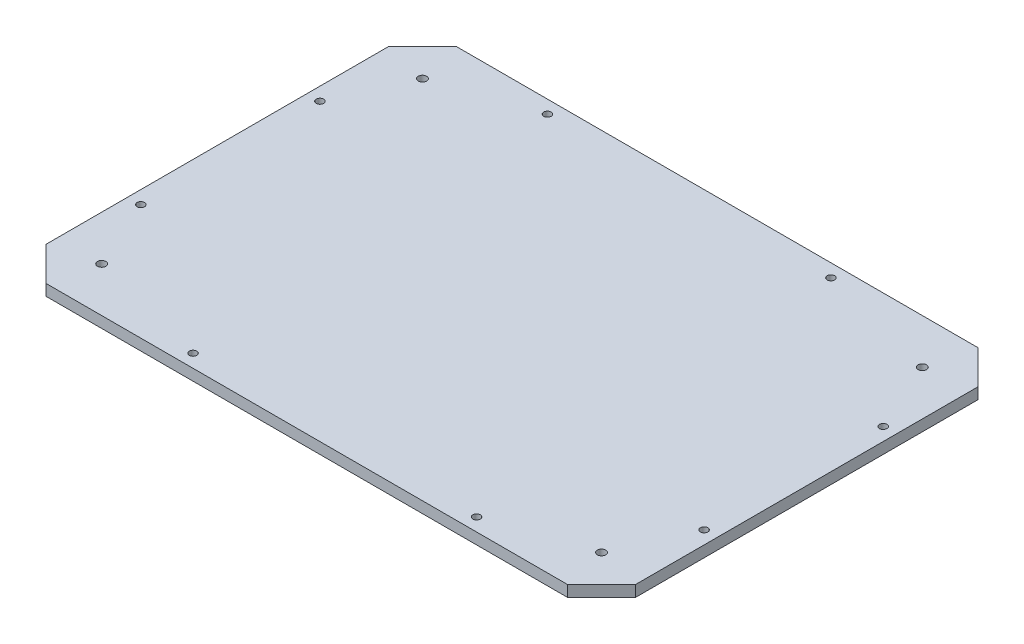
ISO-10303-21;
HEADER;
FILE_DESCRIPTION(('STEP AP214'),'2;1');
FILE_NAME('part.step','',(''),(''),'','','');
FILE_SCHEMA(('AUTOMOTIVE_DESIGN { 1 0 10303 214 1 1 1 1 }'));
ENDSEC;
DATA;
#1=APPLICATION_CONTEXT('core data for automotive mechanical design processes');
#2=APPLICATION_PROTOCOL_DEFINITION('international standard','automotive_design',2000,#1);
#3=PRODUCT_CONTEXT('',#1,'mechanical');
#4=PRODUCT('Part','Part','',(#3));
#5=PRODUCT_RELATED_PRODUCT_CATEGORY('part','',(#4));
#6=PRODUCT_DEFINITION_FORMATION('','',#4);
#7=PRODUCT_DEFINITION_CONTEXT('part definition',#1,'design');
#8=PRODUCT_DEFINITION('design','',#6,#7);
#9=PRODUCT_DEFINITION_SHAPE('','',#8);
#10=(LENGTH_UNIT() NAMED_UNIT(*) SI_UNIT(.MILLI.,.METRE.));
#11=(NAMED_UNIT(*) PLANE_ANGLE_UNIT() SI_UNIT($,.RADIAN.));
#12=(NAMED_UNIT(*) SI_UNIT($,.STERADIAN.) SOLID_ANGLE_UNIT());
#13=UNCERTAINTY_MEASURE_WITH_UNIT(LENGTH_MEASURE(1.E-05),#10,'distance_accuracy_value','');
#14=(GEOMETRIC_REPRESENTATION_CONTEXT(3) GLOBAL_UNCERTAINTY_ASSIGNED_CONTEXT((#13)) GLOBAL_UNIT_ASSIGNED_CONTEXT((#10,
#11,#12)) REPRESENTATION_CONTEXT('',''));
#15=CARTESIAN_POINT('',(0.,0.,0.));
#16=DIRECTION('',(0.,0.,1.));
#17=DIRECTION('',(1.,0.,0.));
#18=AXIS2_PLACEMENT_3D('',#15,#16,#17);
#19=CARTESIAN_POINT('',(8.4882527000098,9.52500000000001,0.));
#20=DIRECTION('',(1.,0.,0.));
#21=DIRECTION('',(0.,0.,-1.));
#22=AXIS2_PLACEMENT_3D('',#19,#20,#21);
#23=PLANE('',#22);
#24=DIRECTION('',(0.,0.,1.));
#25=VECTOR('',#24,1.);
#26=CARTESIAN_POINT('',(8.4882527000098,0.,0.));
#27=LINE('',#26,#25);
#28=CARTESIAN_POINT('',(8.48825270000981,0.,28.8254840000385));
#29=VERTEX_POINT('',#28);
#30=CARTESIAN_POINT('',(8.48825270000984,0.,320.424515999961));
#31=VERTEX_POINT('',#30);
#32=EDGE_CURVE('E130',#29,#31,#27,.T.);
#33=ORIENTED_EDGE('',*,*,#32,.T.);
#34=DIRECTION('',(0.,1.,0.));
#35=VECTOR('',#34,1.);
#36=CARTESIAN_POINT('',(8.48825270000981,-40.7653904148234,320.424515999961));
#37=LINE('',#36,#35);
#38=CARTESIAN_POINT('',(8.48825270000981,9.52500000000001,320.424515999961));
#39=VERTEX_POINT('',#38);
#40=EDGE_CURVE('E278',#31,#39,#37,.T.);
#41=ORIENTED_EDGE('',*,*,#40,.T.);
#42=DIRECTION('',(0.,0.,1.));
#43=VECTOR('',#42,1.);
#44=CARTESIAN_POINT('',(8.4882527000098,9.52500000000001,0.));
#45=LINE('',#44,#43);
#46=CARTESIAN_POINT('',(8.48825270000981,9.52500000000001,28.8254840000385));
#47=VERTEX_POINT('',#46);
#48=EDGE_CURVE('E126',#47,#39,#45,.T.);
#49=ORIENTED_EDGE('',*,*,#48,.F.);
#50=DIRECTION('',(0.,1.,0.));
#51=VECTOR('',#50,1.);
#52=CARTESIAN_POINT('',(8.48825270000981,-40.7653904148234,28.8254840000385));
#53=LINE('',#52,#51);
#54=EDGE_CURVE('E276',#29,#47,#53,.T.);
#55=ORIENTED_EDGE('',*,*,#54,.F.);
#56=EDGE_LOOP('',(#33,#41,#49,#55));
#57=FACE_BOUND('',#56,.T.);
#58=ADVANCED_FACE('F33',(#57),#23,.F.);
#59=CARTESIAN_POINT('',(8.48825270000984,9.52500000000001,349.25));
#60=DIRECTION('',(0.,0.,-1.));
#61=DIRECTION('',(-1.,0.,0.));
#62=AXIS2_PLACEMENT_3D('',#59,#60,#61);
#63=PLANE('',#62);
#64=DIRECTION('',(1.,0.,0.));
#65=VECTOR('',#64,1.);
#66=CARTESIAN_POINT('',(8.48825270000984,9.52500000000001,349.25));
#67=LINE('',#66,#65);
#68=CARTESIAN_POINT('',(37.3137367000486,9.52500000000001,349.25));
#69=VERTEX_POINT('',#68);
#70=CARTESIAN_POINT('',(481.312768699971,9.52500000000001,349.25));
#71=VERTEX_POINT('',#70);
#72=EDGE_CURVE('E122',#69,#71,#67,.T.);
#73=ORIENTED_EDGE('',*,*,#72,.F.);
#74=DIRECTION('',(0.,1.,0.));
#75=VECTOR('',#74,1.);
#76=CARTESIAN_POINT('',(37.3137367000486,-40.7653904148234,349.25));
#77=LINE('',#76,#75);
#78=CARTESIAN_POINT('',(37.3137367000486,0.,349.25));
#79=VERTEX_POINT('',#78);
#80=EDGE_CURVE('E281',#79,#69,#77,.T.);
#81=ORIENTED_EDGE('',*,*,#80,.F.);
#82=DIRECTION('',(1.,0.,0.));
#83=VECTOR('',#82,1.);
#84=CARTESIAN_POINT('',(8.48825270000984,0.,349.25));
#85=LINE('',#84,#83);
#86=CARTESIAN_POINT('',(481.312768699971,0.,349.25));
#87=VERTEX_POINT('',#86);
#88=EDGE_CURVE('E133',#79,#87,#85,.T.);
#89=ORIENTED_EDGE('',*,*,#88,.T.);
#90=DIRECTION('',(0.,1.,0.));
#91=VECTOR('',#90,1.);
#92=CARTESIAN_POINT('',(481.312768699971,-40.7653904148234,349.25));
#93=LINE('',#92,#91);
#94=EDGE_CURVE('E48',#87,#71,#93,.T.);
#95=ORIENTED_EDGE('',*,*,#94,.T.);
#96=EDGE_LOOP('',(#73,#81,#89,#95));
#97=FACE_BOUND('',#96,.T.);
#98=ADVANCED_FACE('F178',(#97),#63,.F.);
#99=CARTESIAN_POINT('',(510.13825270001,9.52500000000001,0.));
#100=DIRECTION('',(-1.,0.,0.));
#101=DIRECTION('',(0.,0.,1.));
#102=AXIS2_PLACEMENT_3D('',#99,#100,#101);
#103=PLANE('',#102);
#104=DIRECTION('',(0.,0.,-1.));
#105=VECTOR('',#104,1.);
#106=CARTESIAN_POINT('',(510.13825270001,9.52500000000001,0.));
#107=LINE('',#106,#105);
#108=CARTESIAN_POINT('',(510.13825270001,9.52500000000001,320.424515999961));
#109=VERTEX_POINT('',#108);
#110=CARTESIAN_POINT('',(510.13825270001,9.52500000000001,28.8254840000385));
#111=VERTEX_POINT('',#110);
#112=EDGE_CURVE('E111',#109,#111,#107,.T.);
#113=ORIENTED_EDGE('',*,*,#112,.F.);
#114=DIRECTION('',(0.,1.,0.));
#115=VECTOR('',#114,1.);
#116=CARTESIAN_POINT('',(510.13825270001,-40.7653904148234,320.424515999961));
#117=LINE('',#116,#115);
#118=CARTESIAN_POINT('',(510.13825270001,0.,320.424515999961));
#119=VERTEX_POINT('',#118);
#120=EDGE_CURVE('E305',#119,#109,#117,.T.);
#121=ORIENTED_EDGE('',*,*,#120,.F.);
#122=DIRECTION('',(0.,0.,-1.));
#123=VECTOR('',#122,1.);
#124=CARTESIAN_POINT('',(510.13825270001,0.,0.));
#125=LINE('',#124,#123);
#126=CARTESIAN_POINT('',(510.13825270001,0.,28.8254840000385));
#127=VERTEX_POINT('',#126);
#128=EDGE_CURVE('E113',#119,#127,#125,.T.);
#129=ORIENTED_EDGE('',*,*,#128,.T.);
#130=DIRECTION('',(0.,1.,0.));
#131=VECTOR('',#130,1.);
#132=CARTESIAN_POINT('',(510.13825270001,-40.7653904148234,28.8254840000385));
#133=LINE('',#132,#131);
#134=EDGE_CURVE('E56',#127,#111,#133,.T.);
#135=ORIENTED_EDGE('',*,*,#134,.T.);
#136=EDGE_LOOP('',(#113,#121,#129,#135));
#137=FACE_BOUND('',#136,.T.);
#138=ADVANCED_FACE('F109',(#137),#103,.F.);
#139=CARTESIAN_POINT('',(8.4882527000098,9.52500000000001,0.));
#140=DIRECTION('',(0.,0.,1.));
#141=DIRECTION('',(1.,0.,0.));
#142=AXIS2_PLACEMENT_3D('',#139,#140,#141);
#143=PLANE('',#142);
#144=DIRECTION('',(-1.,0.,0.));
#145=VECTOR('',#144,1.);
#146=CARTESIAN_POINT('',(8.4882527000098,9.52500000000001,0.));
#147=LINE('',#146,#145);
#148=CARTESIAN_POINT('',(481.312768699971,9.52500000000001,0.));
#149=VERTEX_POINT('',#148);
#150=CARTESIAN_POINT('',(37.3137367000486,9.52500000000001,0.));
#151=VERTEX_POINT('',#150);
#152=EDGE_CURVE('E121',#149,#151,#147,.T.);
#153=ORIENTED_EDGE('',*,*,#152,.F.);
#154=DIRECTION('',(0.,1.,0.));
#155=VECTOR('',#154,1.);
#156=CARTESIAN_POINT('',(481.312768699971,-40.7653904148234,0.));
#157=LINE('',#156,#155);
#158=CARTESIAN_POINT('',(481.312768699971,0.,0.));
#159=VERTEX_POINT('',#158);
#160=EDGE_CURVE('E99',#159,#149,#157,.T.);
#161=ORIENTED_EDGE('',*,*,#160,.F.);
#162=DIRECTION('',(-1.,0.,0.));
#163=VECTOR('',#162,1.);
#164=CARTESIAN_POINT('',(8.4882527000098,0.,0.));
#165=LINE('',#164,#163);
#166=CARTESIAN_POINT('',(37.3137367000487,0.,0.));
#167=VERTEX_POINT('',#166);
#168=EDGE_CURVE('E138',#159,#167,#165,.T.);
#169=ORIENTED_EDGE('',*,*,#168,.T.);
#170=DIRECTION('',(0.,1.,0.));
#171=VECTOR('',#170,1.);
#172=CARTESIAN_POINT('',(37.3137367000486,-40.7653904148234,0.));
#173=LINE('',#172,#171);
#174=EDGE_CURVE('E288',#167,#151,#173,.T.);
#175=ORIENTED_EDGE('',*,*,#174,.T.);
#176=EDGE_LOOP('',(#153,#161,#169,#175));
#177=FACE_BOUND('',#176,.T.);
#178=ADVANCED_FACE('F299',(#177),#143,.F.);
#179=CARTESIAN_POINT('',(0.,9.52500000000001,0.));
#180=DIRECTION('',(0.,1.,0.));
#181=DIRECTION('',(0.,0.,1.));
#182=AXIS2_PLACEMENT_3D('',#179,#180,#181);
#183=PLANE('',#182);
#184=DIRECTION('',(-0.707106781186551,0.,-0.707106781186544));
#185=VECTOR('',#184,1.);
#186=CARTESIAN_POINT('',(37.3137367000486,9.52500000000001,349.25));
#187=LINE('',#186,#185);
#188=EDGE_CURVE('E271',#69,#39,#187,.T.);
#189=ORIENTED_EDGE('',*,*,#188,.F.);
#190=ORIENTED_EDGE('',*,*,#72,.T.);
#191=DIRECTION('',(-0.707106781186551,0.,0.707106781186543));
#192=VECTOR('',#191,1.);
#193=CARTESIAN_POINT('',(481.312768699971,9.52500000000001,349.25));
#194=LINE('',#193,#192);
#195=EDGE_CURVE('E120',#109,#71,#194,.T.);
#196=ORIENTED_EDGE('',*,*,#195,.F.);
#197=ORIENTED_EDGE('',*,*,#112,.T.);
#198=DIRECTION('',(0.707106781186552,0.,0.707106781186543));
#199=VECTOR('',#198,1.);
#200=CARTESIAN_POINT('',(481.312768699971,9.52500000000001,0.));
#201=LINE('',#200,#199);
#202=EDGE_CURVE('E96',#149,#111,#201,.T.);
#203=ORIENTED_EDGE('',*,*,#202,.F.);
#204=ORIENTED_EDGE('',*,*,#152,.T.);
#205=DIRECTION('',(0.707106781186552,0.,-0.707106781186543));
#206=VECTOR('',#205,1.);
#207=CARTESIAN_POINT('',(37.3137367000486,9.52500000000001,0.));
#208=LINE('',#207,#206);
#209=EDGE_CURVE('E273',#47,#151,#208,.T.);
#210=ORIENTED_EDGE('',*,*,#209,.F.);
#211=ORIENTED_EDGE('',*,*,#48,.T.);
#212=EDGE_LOOP('',(#189,#190,#196,#197,#203,#204,#210,#211));
#213=FACE_BOUND('',#212,.T.);
#214=CARTESIAN_POINT('',(46.5882527000121,9.52500000000001,38.1000000000002));
#215=DIRECTION('',(0.,1.,0.));
#216=DIRECTION('',(0.,0.,1.));
#217=AXIS2_PLACEMENT_3D('',#214,#215,#216);
#218=CIRCLE('',#217,3.571875);
#219=CARTESIAN_POINT('',(46.5882527000121,9.52500000000001,41.6718750000002));
#220=VERTEX_POINT('',#219);
#221=EDGE_CURVE('E210',#220,#220,#218,.T.);
#222=ORIENTED_EDGE('',*,*,#221,.F.);
#223=EDGE_LOOP('',(#222));
#224=FACE_BOUND('',#223,.T.);
#225=CARTESIAN_POINT('',(46.5882527000121,9.52500000000001,311.149999999993));
#226=DIRECTION('',(0.,1.,0.));
#227=DIRECTION('',(0.,0.,1.));
#228=AXIS2_PLACEMENT_3D('',#225,#226,#227);
#229=CIRCLE('',#228,3.571875);
#230=CARTESIAN_POINT('',(46.5882527000121,9.52500000000001,314.721874999993));
#231=VERTEX_POINT('',#230);
#232=EDGE_CURVE('E207',#231,#231,#229,.T.);
#233=ORIENTED_EDGE('',*,*,#232,.F.);
#234=EDGE_LOOP('',(#233));
#235=FACE_BOUND('',#234,.T.);
#236=CARTESIAN_POINT('',(472.038252700011,9.52500000000001,311.149999999993));
#237=DIRECTION('',(0.,1.,0.));
#238=DIRECTION('',(0.,0.,1.));
#239=AXIS2_PLACEMENT_3D('',#236,#237,#238);
#240=CIRCLE('',#239,3.57187499999998);
#241=CARTESIAN_POINT('',(472.038252700011,9.52500000000001,314.721874999993));
#242=VERTEX_POINT('',#241);
#243=EDGE_CURVE('E209',#242,#242,#240,.T.);
#244=ORIENTED_EDGE('',*,*,#243,.F.);
#245=EDGE_LOOP('',(#244));
#246=FACE_BOUND('',#245,.T.);
#247=CARTESIAN_POINT('',(472.038252700012,9.52500000000001,38.0999999999988));
#248=DIRECTION('',(0.,1.,0.));
#249=DIRECTION('',(0.,0.,1.));
#250=AXIS2_PLACEMENT_3D('',#247,#248,#249);
#251=CIRCLE('',#250,3.57187499999998);
#252=CARTESIAN_POINT('',(472.038252700012,9.52500000000001,41.6718749999988));
#253=VERTEX_POINT('',#252);
#254=EDGE_CURVE('E213',#253,#253,#251,.T.);
#255=ORIENTED_EDGE('',*,*,#254,.F.);
#256=EDGE_LOOP('',(#255));
#257=FACE_BOUND('',#256,.T.);
#258=CARTESIAN_POINT('',(499.02575270001,9.52500000000001,98.4250000000003));
#259=DIRECTION('',(0.,1.,0.));
#260=DIRECTION('',(0.,0.,1.));
#261=AXIS2_PLACEMENT_3D('',#258,#259,#260);
#262=CIRCLE('',#261,3.17500000000014);
#263=CARTESIAN_POINT('',(499.02575270001,9.52500000000001,101.6));
#264=VERTEX_POINT('',#263);
#265=EDGE_CURVE('E222',#264,#264,#262,.T.);
#266=ORIENTED_EDGE('',*,*,#265,.F.);
#267=EDGE_LOOP('',(#266));
#268=FACE_BOUND('',#267,.T.);
#269=CARTESIAN_POINT('',(499.025752700008,9.52500000000001,250.825));
#270=DIRECTION('',(0.,1.,0.));
#271=DIRECTION('',(0.,0.,1.));
#272=AXIS2_PLACEMENT_3D('',#269,#270,#271);
#273=CIRCLE('',#272,3.17499999999997);
#274=CARTESIAN_POINT('',(499.025752700008,9.52500000000001,254.));
#275=VERTEX_POINT('',#274);
#276=EDGE_CURVE('E237',#275,#275,#273,.T.);
#277=ORIENTED_EDGE('',*,*,#276,.F.);
#278=EDGE_LOOP('',(#277));
#279=FACE_BOUND('',#278,.T.);
#280=CARTESIAN_POINT('',(19.6007527000113,9.52500000000001,98.4249999999999));
#281=DIRECTION('',(0.,1.,0.));
#282=DIRECTION('',(0.,0.,1.));
#283=AXIS2_PLACEMENT_3D('',#280,#281,#282);
#284=CIRCLE('',#283,3.17500000000001);
#285=CARTESIAN_POINT('',(19.6007527000113,9.52500000000001,101.6));
#286=VERTEX_POINT('',#285);
#287=EDGE_CURVE('E231',#286,#286,#284,.T.);
#288=ORIENTED_EDGE('',*,*,#287,.F.);
#289=EDGE_LOOP('',(#288));
#290=FACE_BOUND('',#289,.T.);
#291=CARTESIAN_POINT('',(19.6007527000118,9.52500000000001,250.825));
#292=DIRECTION('',(0.,1.,0.));
#293=DIRECTION('',(0.,0.,1.));
#294=AXIS2_PLACEMENT_3D('',#291,#292,#293);
#295=CIRCLE('',#294,3.17500000000003);
#296=CARTESIAN_POINT('',(19.6007527000118,9.52500000000001,254.));
#297=VERTEX_POINT('',#296);
#298=EDGE_CURVE('E223',#297,#297,#295,.T.);
#299=ORIENTED_EDGE('',*,*,#298,.F.);
#300=EDGE_LOOP('',(#299));
#301=FACE_BOUND('',#300,.T.);
#302=CARTESIAN_POINT('',(125.963252700011,9.52500000000001,11.1125000000004));
#303=DIRECTION('',(0.,1.,0.));
#304=DIRECTION('',(0.,0.,1.));
#305=AXIS2_PLACEMENT_3D('',#302,#303,#304);
#306=CIRCLE('',#305,3.17499999999997);
#307=CARTESIAN_POINT('',(125.963252700011,9.52500000000001,14.2875000000004));
#308=VERTEX_POINT('',#307);
#309=EDGE_CURVE('E230',#308,#308,#306,.T.);
#310=ORIENTED_EDGE('',*,*,#309,.F.);
#311=EDGE_LOOP('',(#310));
#312=FACE_BOUND('',#311,.T.);
#313=CARTESIAN_POINT('',(367.263252700011,9.52500000000001,11.1125000000004));
#314=DIRECTION('',(0.,1.,0.));
#315=DIRECTION('',(0.,0.,1.));
#316=AXIS2_PLACEMENT_3D('',#313,#314,#315);
#317=CIRCLE('',#316,3.17499999999997);
#318=CARTESIAN_POINT('',(367.263252700011,9.52500000000001,14.2875000000004));
#319=VERTEX_POINT('',#318);
#320=EDGE_CURVE('E255',#319,#319,#317,.T.);
#321=ORIENTED_EDGE('',*,*,#320,.F.);
#322=EDGE_LOOP('',(#321));
#323=FACE_BOUND('',#322,.T.);
#324=CARTESIAN_POINT('',(151.363252700012,9.52500000000001,338.137499999998));
#325=DIRECTION('',(0.,1.,0.));
#326=DIRECTION('',(0.,0.,1.));
#327=AXIS2_PLACEMENT_3D('',#324,#325,#326);
#328=CIRCLE('',#327,3.175);
#329=CARTESIAN_POINT('',(151.363252700012,9.52500000000001,341.312499999998));
#330=VERTEX_POINT('',#329);
#331=EDGE_CURVE('E247',#330,#330,#328,.T.);
#332=ORIENTED_EDGE('',*,*,#331,.F.);
#333=EDGE_LOOP('',(#332));
#334=FACE_BOUND('',#333,.T.);
#335=CARTESIAN_POINT('',(392.663252700012,9.52500000000001,338.137499999995));
#336=DIRECTION('',(0.,1.,0.));
#337=DIRECTION('',(0.,0.,1.));
#338=AXIS2_PLACEMENT_3D('',#335,#336,#337);
#339=CIRCLE('',#338,3.17499999999997);
#340=CARTESIAN_POINT('',(392.663252700012,9.52500000000001,341.312499999995));
#341=VERTEX_POINT('',#340);
#342=EDGE_CURVE('E254',#341,#341,#339,.T.);
#343=ORIENTED_EDGE('',*,*,#342,.F.);
#344=EDGE_LOOP('',(#343));
#345=FACE_BOUND('',#344,.T.);
#346=ADVANCED_FACE('F117',(#213,#224,#235,#246,#257,#268,#279,#290,#301,#312,#323,#334,#345),
#183,.T.);
#347=CARTESIAN_POINT('',(0.,0.,0.));
#348=DIRECTION('',(0.,1.,0.));
#349=DIRECTION('',(0.,0.,1.));
#350=AXIS2_PLACEMENT_3D('',#347,#348,#349);
#351=PLANE('',#350);
#352=CARTESIAN_POINT('',(46.5882527000121,0.,311.149999999993));
#353=DIRECTION('',(0.,1.,0.));
#354=DIRECTION('',(0.,0.,1.));
#355=AXIS2_PLACEMENT_3D('',#352,#353,#354);
#356=CIRCLE('',#355,6.49287500000001);
#357=CARTESIAN_POINT('',(46.5882527000121,0.,317.642874999993));
#358=VERTEX_POINT('',#357);
#359=EDGE_CURVE('E152',#358,#358,#356,.T.);
#360=ORIENTED_EDGE('',*,*,#359,.T.);
#361=EDGE_LOOP('',(#360));
#362=FACE_BOUND('',#361,.T.);
#363=CARTESIAN_POINT('',(46.5882527000121,0.,38.1000000000002));
#364=DIRECTION('',(0.,1.,0.));
#365=DIRECTION('',(0.,0.,1.));
#366=AXIS2_PLACEMENT_3D('',#363,#364,#365);
#367=CIRCLE('',#366,6.49287499999995);
#368=CARTESIAN_POINT('',(46.5882527000121,0.,44.5928750000001));
#369=VERTEX_POINT('',#368);
#370=EDGE_CURVE('E149',#369,#369,#367,.T.);
#371=ORIENTED_EDGE('',*,*,#370,.T.);
#372=EDGE_LOOP('',(#371));
#373=FACE_BOUND('',#372,.T.);
#374=CARTESIAN_POINT('',(472.038252700012,0.,38.0999999999988));
#375=DIRECTION('',(0.,1.,0.));
#376=DIRECTION('',(0.,0.,1.));
#377=AXIS2_PLACEMENT_3D('',#374,#375,#376);
#378=CIRCLE('',#377,6.49287500000001);
#379=CARTESIAN_POINT('',(472.038252700012,0.,44.5928749999988));
#380=VERTEX_POINT('',#379);
#381=EDGE_CURVE('E146',#380,#380,#378,.T.);
#382=ORIENTED_EDGE('',*,*,#381,.T.);
#383=EDGE_LOOP('',(#382));
#384=FACE_BOUND('',#383,.T.);
#385=CARTESIAN_POINT('',(472.038252700011,0.,311.149999999993));
#386=DIRECTION('',(0.,1.,0.));
#387=DIRECTION('',(0.,0.,1.));
#388=AXIS2_PLACEMENT_3D('',#385,#386,#387);
#389=CIRCLE('',#388,6.49287499999995);
#390=CARTESIAN_POINT('',(472.038252700011,0.,317.642874999993));
#391=VERTEX_POINT('',#390);
#392=EDGE_CURVE('E143',#391,#391,#389,.T.);
#393=ORIENTED_EDGE('',*,*,#392,.T.);
#394=EDGE_LOOP('',(#393));
#395=FACE_BOUND('',#394,.T.);
#396=CARTESIAN_POINT('',(499.02575270001,0.,98.4250000000003));
#397=DIRECTION('',(0.,1.,0.));
#398=DIRECTION('',(0.,0.,1.));
#399=AXIS2_PLACEMENT_3D('',#396,#397,#398);
#400=CIRCLE('',#399,3.17500000000014);
#401=CARTESIAN_POINT('',(499.02575270001,0.,101.6));
#402=VERTEX_POINT('',#401);
#403=EDGE_CURVE('E240',#402,#402,#400,.F.);
#404=ORIENTED_EDGE('',*,*,#403,.F.);
#405=EDGE_LOOP('',(#404));
#406=FACE_BOUND('',#405,.T.);
#407=CARTESIAN_POINT('',(499.025752700008,0.,250.825));
#408=DIRECTION('',(0.,1.,0.));
#409=DIRECTION('',(0.,0.,1.));
#410=AXIS2_PLACEMENT_3D('',#407,#408,#409);
#411=CIRCLE('',#410,3.17499999999997);
#412=CARTESIAN_POINT('',(499.025752700008,0.,254.));
#413=VERTEX_POINT('',#412);
#414=EDGE_CURVE('E234',#413,#413,#411,.F.);
#415=ORIENTED_EDGE('',*,*,#414,.F.);
#416=EDGE_LOOP('',(#415));
#417=FACE_BOUND('',#416,.T.);
#418=CARTESIAN_POINT('',(19.6007527000113,0.,98.4249999999999));
#419=DIRECTION('',(0.,1.,0.));
#420=DIRECTION('',(0.,0.,1.));
#421=AXIS2_PLACEMENT_3D('',#418,#419,#420);
#422=CIRCLE('',#421,3.17500000000001);
#423=CARTESIAN_POINT('',(19.6007527000113,0.,101.6));
#424=VERTEX_POINT('',#423);
#425=EDGE_CURVE('E227',#424,#424,#422,.F.);
#426=ORIENTED_EDGE('',*,*,#425,.F.);
#427=EDGE_LOOP('',(#426));
#428=FACE_BOUND('',#427,.T.);
#429=CARTESIAN_POINT('',(19.6007527000118,0.,250.825));
#430=DIRECTION('',(0.,1.,0.));
#431=DIRECTION('',(0.,0.,1.));
#432=AXIS2_PLACEMENT_3D('',#429,#430,#431);
#433=CIRCLE('',#432,3.17500000000003);
#434=CARTESIAN_POINT('',(19.6007527000118,0.,254.));
#435=VERTEX_POINT('',#434);
#436=EDGE_CURVE('E226',#435,#435,#433,.F.);
#437=ORIENTED_EDGE('',*,*,#436,.F.);
#438=EDGE_LOOP('',(#437));
#439=FACE_BOUND('',#438,.T.);
#440=CARTESIAN_POINT('',(125.963252700011,0.,11.1125000000004));
#441=DIRECTION('',(0.,1.,0.));
#442=DIRECTION('',(0.,0.,1.));
#443=AXIS2_PLACEMENT_3D('',#440,#441,#442);
#444=CIRCLE('',#443,3.17499999999997);
#445=CARTESIAN_POINT('',(125.963252700011,0.,14.2875000000004));
#446=VERTEX_POINT('',#445);
#447=EDGE_CURVE('E258',#446,#446,#444,.F.);
#448=ORIENTED_EDGE('',*,*,#447,.F.);
#449=EDGE_LOOP('',(#448));
#450=FACE_BOUND('',#449,.T.);
#451=CARTESIAN_POINT('',(367.263252700011,0.,11.1125000000004));
#452=DIRECTION('',(0.,1.,0.));
#453=DIRECTION('',(0.,0.,1.));
#454=AXIS2_PLACEMENT_3D('',#451,#452,#453);
#455=CIRCLE('',#454,3.17499999999997);
#456=CARTESIAN_POINT('',(367.263252700011,0.,14.2875000000004));
#457=VERTEX_POINT('',#456);
#458=EDGE_CURVE('E251',#457,#457,#455,.F.);
#459=ORIENTED_EDGE('',*,*,#458,.F.);
#460=EDGE_LOOP('',(#459));
#461=FACE_BOUND('',#460,.T.);
#462=CARTESIAN_POINT('',(151.363252700012,0.,338.137499999998));
#463=DIRECTION('',(0.,1.,0.));
#464=DIRECTION('',(0.,0.,1.));
#465=AXIS2_PLACEMENT_3D('',#462,#463,#464);
#466=CIRCLE('',#465,3.175);
#467=CARTESIAN_POINT('',(151.363252700012,0.,341.312499999998));
#468=VERTEX_POINT('',#467);
#469=EDGE_CURVE('E250',#468,#468,#466,.F.);
#470=ORIENTED_EDGE('',*,*,#469,.F.);
#471=EDGE_LOOP('',(#470));
#472=FACE_BOUND('',#471,.T.);
#473=CARTESIAN_POINT('',(392.663252700012,0.,338.137499999995));
#474=DIRECTION('',(0.,1.,0.));
#475=DIRECTION('',(0.,0.,1.));
#476=AXIS2_PLACEMENT_3D('',#473,#474,#475);
#477=CIRCLE('',#476,3.17499999999997);
#478=CARTESIAN_POINT('',(392.663252700012,0.,341.312499999995));
#479=VERTEX_POINT('',#478);
#480=EDGE_CURVE('E134',#479,#479,#477,.F.);
#481=ORIENTED_EDGE('',*,*,#480,.F.);
#482=EDGE_LOOP('',(#481));
#483=FACE_BOUND('',#482,.T.);
#484=ORIENTED_EDGE('',*,*,#88,.F.);
#485=DIRECTION('',(0.707106781186551,0.,0.707106781186544));
#486=VECTOR('',#485,1.);
#487=CARTESIAN_POINT('',(37.3137367000486,0.,349.25));
#488=LINE('',#487,#486);
#489=EDGE_CURVE('E283',#31,#79,#488,.T.);
#490=ORIENTED_EDGE('',*,*,#489,.F.);
#491=ORIENTED_EDGE('',*,*,#32,.F.);
#492=DIRECTION('',(-0.707106781186552,0.,0.707106781186543));
#493=VECTOR('',#492,1.);
#494=CARTESIAN_POINT('',(37.3137367000486,0.,0.));
#495=LINE('',#494,#493);
#496=EDGE_CURVE('E216',#167,#29,#495,.T.);
#497=ORIENTED_EDGE('',*,*,#496,.F.);
#498=ORIENTED_EDGE('',*,*,#168,.F.);
#499=DIRECTION('',(-0.707106781186552,0.,-0.707106781186543));
#500=VECTOR('',#499,1.);
#501=CARTESIAN_POINT('',(481.312768699971,0.,0.));
#502=LINE('',#501,#500);
#503=EDGE_CURVE('E290',#127,#159,#502,.T.);
#504=ORIENTED_EDGE('',*,*,#503,.F.);
#505=ORIENTED_EDGE('',*,*,#128,.F.);
#506=DIRECTION('',(0.707106781186552,0.,-0.707106781186544));
#507=VECTOR('',#506,1.);
#508=CARTESIAN_POINT('',(481.312768699971,0.,349.25));
#509=LINE('',#508,#507);
#510=EDGE_CURVE('E104',#87,#119,#509,.T.);
#511=ORIENTED_EDGE('',*,*,#510,.F.);
#512=EDGE_LOOP('',(#484,#490,#491,#497,#498,#504,#505,#511));
#513=FACE_BOUND('',#512,.T.);
#514=ADVANCED_FACE('F297',(#362,#373,#384,#395,#406,#417,#428,#439,#450,#461,#472,#483,#513),
#351,.F.);
#515=CARTESIAN_POINT('',(392.663252700012,-8.98025612106951,338.137499999995));
#516=DIRECTION('',(0.,1.,0.));
#517=DIRECTION('',(0.,0.,1.));
#518=AXIS2_PLACEMENT_3D('',#515,#516,#517);
#519=CYLINDRICAL_SURFACE('',#518,3.17499999999997);
#520=ORIENTED_EDGE('',*,*,#480,.T.);
#521=EDGE_LOOP('',(#520));
#522=FACE_BOUND('',#521,.T.);
#523=ORIENTED_EDGE('',*,*,#342,.T.);
#524=EDGE_LOOP('',(#523));
#525=FACE_BOUND('',#524,.T.);
#526=ADVANCED_FACE('F348',(#522,#525),#519,.F.);
#527=CARTESIAN_POINT('',(151.363252700012,-8.98025612106951,338.137499999998));
#528=DIRECTION('',(0.,1.,0.));
#529=DIRECTION('',(0.,0.,1.));
#530=AXIS2_PLACEMENT_3D('',#527,#528,#529);
#531=CYLINDRICAL_SURFACE('',#530,3.175);
#532=ORIENTED_EDGE('',*,*,#469,.T.);
#533=EDGE_LOOP('',(#532));
#534=FACE_BOUND('',#533,.T.);
#535=ORIENTED_EDGE('',*,*,#331,.T.);
#536=EDGE_LOOP('',(#535));
#537=FACE_BOUND('',#536,.T.);
#538=ADVANCED_FACE('F344',(#534,#537),#531,.F.);
#539=CARTESIAN_POINT('',(367.263252700011,-8.98025612106951,11.1125000000004));
#540=DIRECTION('',(0.,1.,0.));
#541=DIRECTION('',(0.,0.,1.));
#542=AXIS2_PLACEMENT_3D('',#539,#540,#541);
#543=CYLINDRICAL_SURFACE('',#542,3.17499999999997);
#544=ORIENTED_EDGE('',*,*,#458,.T.);
#545=EDGE_LOOP('',(#544));
#546=FACE_BOUND('',#545,.T.);
#547=ORIENTED_EDGE('',*,*,#320,.T.);
#548=EDGE_LOOP('',(#547));
#549=FACE_BOUND('',#548,.T.);
#550=ADVANCED_FACE('F347',(#546,#549),#543,.F.);
#551=CARTESIAN_POINT('',(125.963252700011,-8.98025612106951,11.1125000000004));
#552=DIRECTION('',(0.,1.,0.));
#553=DIRECTION('',(0.,0.,1.));
#554=AXIS2_PLACEMENT_3D('',#551,#552,#553);
#555=CYLINDRICAL_SURFACE('',#554,3.17499999999997);
#556=ORIENTED_EDGE('',*,*,#447,.T.);
#557=EDGE_LOOP('',(#556));
#558=FACE_BOUND('',#557,.T.);
#559=ORIENTED_EDGE('',*,*,#309,.T.);
#560=EDGE_LOOP('',(#559));
#561=FACE_BOUND('',#560,.T.);
#562=ADVANCED_FACE('F332',(#558,#561),#555,.F.);
#563=CARTESIAN_POINT('',(19.6007527000118,-8.98025612106951,250.825));
#564=DIRECTION('',(0.,1.,0.));
#565=DIRECTION('',(0.,0.,1.));
#566=AXIS2_PLACEMENT_3D('',#563,#564,#565);
#567=CYLINDRICAL_SURFACE('',#566,3.17500000000003);
#568=ORIENTED_EDGE('',*,*,#436,.T.);
#569=EDGE_LOOP('',(#568));
#570=FACE_BOUND('',#569,.T.);
#571=ORIENTED_EDGE('',*,*,#298,.T.);
#572=EDGE_LOOP('',(#571));
#573=FACE_BOUND('',#572,.T.);
#574=ADVANCED_FACE('F328',(#570,#573),#567,.F.);
#575=CARTESIAN_POINT('',(19.6007527000113,-8.98025612106951,98.4249999999999));
#576=DIRECTION('',(0.,1.,0.));
#577=DIRECTION('',(0.,0.,1.));
#578=AXIS2_PLACEMENT_3D('',#575,#576,#577);
#579=CYLINDRICAL_SURFACE('',#578,3.17500000000001);
#580=ORIENTED_EDGE('',*,*,#425,.T.);
#581=EDGE_LOOP('',(#580));
#582=FACE_BOUND('',#581,.T.);
#583=ORIENTED_EDGE('',*,*,#287,.T.);
#584=EDGE_LOOP('',(#583));
#585=FACE_BOUND('',#584,.T.);
#586=ADVANCED_FACE('F331',(#582,#585),#579,.F.);
#587=CARTESIAN_POINT('',(499.025752700008,-8.98025612106951,250.825));
#588=DIRECTION('',(0.,1.,0.));
#589=DIRECTION('',(0.,0.,1.));
#590=AXIS2_PLACEMENT_3D('',#587,#588,#589);
#591=CYLINDRICAL_SURFACE('',#590,3.17499999999997);
#592=ORIENTED_EDGE('',*,*,#414,.T.);
#593=EDGE_LOOP('',(#592));
#594=FACE_BOUND('',#593,.T.);
#595=ORIENTED_EDGE('',*,*,#276,.T.);
#596=EDGE_LOOP('',(#595));
#597=FACE_BOUND('',#596,.T.);
#598=ADVANCED_FACE('F336',(#594,#597),#591,.F.);
#599=CARTESIAN_POINT('',(499.02575270001,-8.98025612106951,98.4250000000003));
#600=DIRECTION('',(0.,1.,0.));
#601=DIRECTION('',(0.,0.,1.));
#602=AXIS2_PLACEMENT_3D('',#599,#600,#601);
#603=CYLINDRICAL_SURFACE('',#602,3.17500000000014);
#604=ORIENTED_EDGE('',*,*,#403,.T.);
#605=EDGE_LOOP('',(#604));
#606=FACE_BOUND('',#605,.T.);
#607=ORIENTED_EDGE('',*,*,#265,.T.);
#608=EDGE_LOOP('',(#607));
#609=FACE_BOUND('',#608,.T.);
#610=ADVANCED_FACE('F327',(#606,#609),#603,.F.);
#611=CARTESIAN_POINT('',(472.038252700012,-10.1027881362028,38.0999999999988));
#612=DIRECTION('',(0.,1.,0.));
#613=DIRECTION('',(0.,0.,1.));
#614=AXIS2_PLACEMENT_3D('',#611,#612,#613);
#615=CYLINDRICAL_SURFACE('',#614,3.57187499999998);
#616=CARTESIAN_POINT('',(472.038252700012,2.63008021339406,38.0999999999988));
#617=DIRECTION('',(0.,1.,0.));
#618=DIRECTION('',(0.,0.,1.));
#619=AXIS2_PLACEMENT_3D('',#616,#617,#618);
#620=CIRCLE('',#619,3.57187499999998);
#621=CARTESIAN_POINT('',(472.038252700012,2.63008021339406,41.6718749999988));
#622=VERTEX_POINT('',#621);
#623=EDGE_CURVE('E41',#622,#622,#620,.F.);
#624=ORIENTED_EDGE('',*,*,#623,.T.);
#625=EDGE_LOOP('',(#624));
#626=FACE_BOUND('',#625,.T.);
#627=ORIENTED_EDGE('',*,*,#254,.T.);
#628=EDGE_LOOP('',(#627));
#629=FACE_BOUND('',#628,.T.);
#630=ADVANCED_FACE('F160',(#626,#629),#615,.F.);
#631=CARTESIAN_POINT('',(472.038252700011,-10.1027881362028,311.149999999993));
#632=DIRECTION('',(0.,1.,0.));
#633=DIRECTION('',(0.,0.,1.));
#634=AXIS2_PLACEMENT_3D('',#631,#632,#633);
#635=CYLINDRICAL_SURFACE('',#634,3.57187499999998);
#636=CARTESIAN_POINT('',(472.038252700011,2.630080213394,311.149999999993));
#637=DIRECTION('',(0.,1.,0.));
#638=DIRECTION('',(0.,0.,1.));
#639=AXIS2_PLACEMENT_3D('',#636,#637,#638);
#640=CIRCLE('',#639,3.57187499999998);
#641=CARTESIAN_POINT('',(472.038252700011,2.630080213394,314.721874999993));
#642=VERTEX_POINT('',#641);
#643=EDGE_CURVE('E11',#642,#642,#640,.F.);
#644=ORIENTED_EDGE('',*,*,#643,.T.);
#645=EDGE_LOOP('',(#644));
#646=FACE_BOUND('',#645,.T.);
#647=ORIENTED_EDGE('',*,*,#243,.T.);
#648=EDGE_LOOP('',(#647));
#649=FACE_BOUND('',#648,.T.);
#650=ADVANCED_FACE('F203',(#646,#649),#635,.F.);
#651=CARTESIAN_POINT('',(46.5882527000121,-10.1027881362028,311.149999999993));
#652=DIRECTION('',(0.,1.,0.));
#653=DIRECTION('',(0.,0.,1.));
#654=AXIS2_PLACEMENT_3D('',#651,#652,#653);
#655=CYLINDRICAL_SURFACE('',#654,3.571875);
#656=CARTESIAN_POINT('',(46.5882527000121,2.630080213394,311.149999999993));
#657=DIRECTION('',(0.,1.,0.));
#658=DIRECTION('',(0.,0.,1.));
#659=AXIS2_PLACEMENT_3D('',#656,#657,#658);
#660=CIRCLE('',#659,3.571875);
#661=CARTESIAN_POINT('',(46.5882527000121,2.630080213394,314.721874999993));
#662=VERTEX_POINT('',#661);
#663=EDGE_CURVE('E124',#662,#662,#660,.F.);
#664=ORIENTED_EDGE('',*,*,#663,.T.);
#665=EDGE_LOOP('',(#664));
#666=FACE_BOUND('',#665,.T.);
#667=ORIENTED_EDGE('',*,*,#232,.T.);
#668=EDGE_LOOP('',(#667));
#669=FACE_BOUND('',#668,.T.);
#670=ADVANCED_FACE('F194',(#666,#669),#655,.F.);
#671=CARTESIAN_POINT('',(46.5882527000121,-10.1027881362028,38.1000000000002));
#672=DIRECTION('',(0.,1.,0.));
#673=DIRECTION('',(0.,0.,1.));
#674=AXIS2_PLACEMENT_3D('',#671,#672,#673);
#675=CYLINDRICAL_SURFACE('',#674,3.571875);
#676=CARTESIAN_POINT('',(46.5882527000121,2.63008021339395,38.1000000000002));
#677=DIRECTION('',(0.,1.,0.));
#678=DIRECTION('',(0.,0.,1.));
#679=AXIS2_PLACEMENT_3D('',#676,#677,#678);
#680=CIRCLE('',#679,3.571875);
#681=CARTESIAN_POINT('',(46.5882527000121,2.63008021339395,41.6718750000002));
#682=VERTEX_POINT('',#681);
#683=EDGE_CURVE('E155',#682,#682,#680,.F.);
#684=ORIENTED_EDGE('',*,*,#683,.T.);
#685=EDGE_LOOP('',(#684));
#686=FACE_BOUND('',#685,.T.);
#687=ORIENTED_EDGE('',*,*,#221,.T.);
#688=EDGE_LOOP('',(#687));
#689=FACE_BOUND('',#688,.T.);
#690=ADVANCED_FACE('F189',(#686,#689),#675,.F.);
#691=CARTESIAN_POINT('',(46.5882527000121,2.630080213394,311.149999999993));
#692=DIRECTION('',(0.,-1.,0.));
#693=DIRECTION('',(0.,0.,-1.));
#694=AXIS2_PLACEMENT_3D('',#691,#692,#693);
#695=CONICAL_SURFACE('',#694,3.571875,0.837758040957274);
#696=ORIENTED_EDGE('',*,*,#359,.F.);
#697=EDGE_LOOP('',(#696));
#698=FACE_BOUND('',#697,.T.);
#699=ORIENTED_EDGE('',*,*,#663,.F.);
#700=EDGE_LOOP('',(#699));
#701=FACE_BOUND('',#700,.T.);
#702=ADVANCED_FACE('F173',(#698,#701),#695,.F.);
#703=CARTESIAN_POINT('',(46.5882527000121,2.63008021339395,38.1000000000002));
#704=DIRECTION('',(0.,-1.,0.));
#705=DIRECTION('',(0.,0.,-1.));
#706=AXIS2_PLACEMENT_3D('',#703,#704,#705);
#707=CONICAL_SURFACE('',#706,3.571875,0.837758040957276);
#708=ORIENTED_EDGE('',*,*,#370,.F.);
#709=EDGE_LOOP('',(#708));
#710=FACE_BOUND('',#709,.T.);
#711=ORIENTED_EDGE('',*,*,#683,.F.);
#712=EDGE_LOOP('',(#711));
#713=FACE_BOUND('',#712,.T.);
#714=ADVANCED_FACE('F165',(#710,#713),#707,.F.);
#715=CARTESIAN_POINT('',(472.038252700012,2.63008021339406,38.0999999999988));
#716=DIRECTION('',(0.,-1.,0.));
#717=DIRECTION('',(0.,0.,-1.));
#718=AXIS2_PLACEMENT_3D('',#715,#716,#717);
#719=CONICAL_SURFACE('',#718,3.57187499999998,0.837758040957274);
#720=ORIENTED_EDGE('',*,*,#381,.F.);
#721=EDGE_LOOP('',(#720));
#722=FACE_BOUND('',#721,.T.);
#723=ORIENTED_EDGE('',*,*,#623,.F.);
#724=EDGE_LOOP('',(#723));
#725=FACE_BOUND('',#724,.T.);
#726=ADVANCED_FACE('F163',(#722,#725),#719,.F.);
#727=CARTESIAN_POINT('',(472.038252700011,2.630080213394,311.149999999993));
#728=DIRECTION('',(0.,-1.,0.));
#729=DIRECTION('',(0.,0.,-1.));
#730=AXIS2_PLACEMENT_3D('',#727,#728,#729);
#731=CONICAL_SURFACE('',#730,3.57187499999998,0.837758040957275);
#732=ORIENTED_EDGE('',*,*,#392,.F.);
#733=EDGE_LOOP('',(#732));
#734=FACE_BOUND('',#733,.T.);
#735=ORIENTED_EDGE('',*,*,#643,.F.);
#736=EDGE_LOOP('',(#735));
#737=FACE_BOUND('',#736,.T.);
#738=ADVANCED_FACE('F35',(#734,#737),#731,.F.);
#739=CARTESIAN_POINT('',(37.3137367000486,-40.7653904148234,0.));
#740=DIRECTION('',(0.707106781186543,0.,0.707106781186552));
#741=DIRECTION('',(0.707106781186552,0.,-0.707106781186543));
#742=AXIS2_PLACEMENT_3D('',#739,#740,#741);
#743=PLANE('',#742);
#744=ORIENTED_EDGE('',*,*,#496,.T.);
#745=ORIENTED_EDGE('',*,*,#54,.T.);
#746=ORIENTED_EDGE('',*,*,#209,.T.);
#747=ORIENTED_EDGE('',*,*,#174,.F.);
#748=EDGE_LOOP('',(#744,#745,#746,#747));
#749=FACE_BOUND('',#748,.T.);
#750=ADVANCED_FACE('F171',(#749),#743,.F.);
#751=CARTESIAN_POINT('',(481.312768699971,-40.7653904148234,0.));
#752=DIRECTION('',(-0.707106781186543,0.,0.707106781186552));
#753=DIRECTION('',(0.707106781186552,0.,0.707106781186543));
#754=AXIS2_PLACEMENT_3D('',#751,#752,#753);
#755=PLANE('',#754);
#756=ORIENTED_EDGE('',*,*,#503,.T.);
#757=ORIENTED_EDGE('',*,*,#160,.T.);
#758=ORIENTED_EDGE('',*,*,#202,.T.);
#759=ORIENTED_EDGE('',*,*,#134,.F.);
#760=EDGE_LOOP('',(#756,#757,#758,#759));
#761=FACE_BOUND('',#760,.T.);
#762=ADVANCED_FACE('F97',(#761),#755,.F.);
#763=CARTESIAN_POINT('',(481.312768699971,-40.7653904148234,349.25));
#764=DIRECTION('',(-0.707106781186543,0.,-0.707106781186551));
#765=DIRECTION('',(-0.707106781186552,0.,0.707106781186544));
#766=AXIS2_PLACEMENT_3D('',#763,#764,#765);
#767=PLANE('',#766);
#768=ORIENTED_EDGE('',*,*,#510,.T.);
#769=ORIENTED_EDGE('',*,*,#120,.T.);
#770=ORIENTED_EDGE('',*,*,#195,.T.);
#771=ORIENTED_EDGE('',*,*,#94,.F.);
#772=EDGE_LOOP('',(#768,#769,#770,#771));
#773=FACE_BOUND('',#772,.T.);
#774=ADVANCED_FACE('F310',(#773),#767,.F.);
#775=CARTESIAN_POINT('',(37.3137367000486,-40.7653904148234,349.25));
#776=DIRECTION('',(0.707106781186544,0.,-0.707106781186551));
#777=DIRECTION('',(-0.707106781186551,0.,-0.707106781186544));
#778=AXIS2_PLACEMENT_3D('',#775,#776,#777);
#779=PLANE('',#778);
#780=ORIENTED_EDGE('',*,*,#489,.T.);
#781=ORIENTED_EDGE('',*,*,#80,.T.);
#782=ORIENTED_EDGE('',*,*,#188,.T.);
#783=ORIENTED_EDGE('',*,*,#40,.F.);
#784=EDGE_LOOP('',(#780,#781,#782,#783));
#785=FACE_BOUND('',#784,.T.);
#786=ADVANCED_FACE('F309',(#785),#779,.F.);
#787=CLOSED_SHELL('',(#58,#98,#138,#178,#346,#514,#526,#538,#550,#562,#574,#586,#598,#610,#630,
#650,#670,#690,#702,#714,#726,#738,#750,#762,#774,#786));
#788=MANIFOLD_SOLID_BREP('B2',#787);
#789=ADVANCED_BREP_SHAPE_REPRESENTATION('',(#18,#788),#14);
#790=SHAPE_DEFINITION_REPRESENTATION(#9,#789);
ENDSEC;
END-ISO-10303-21;
